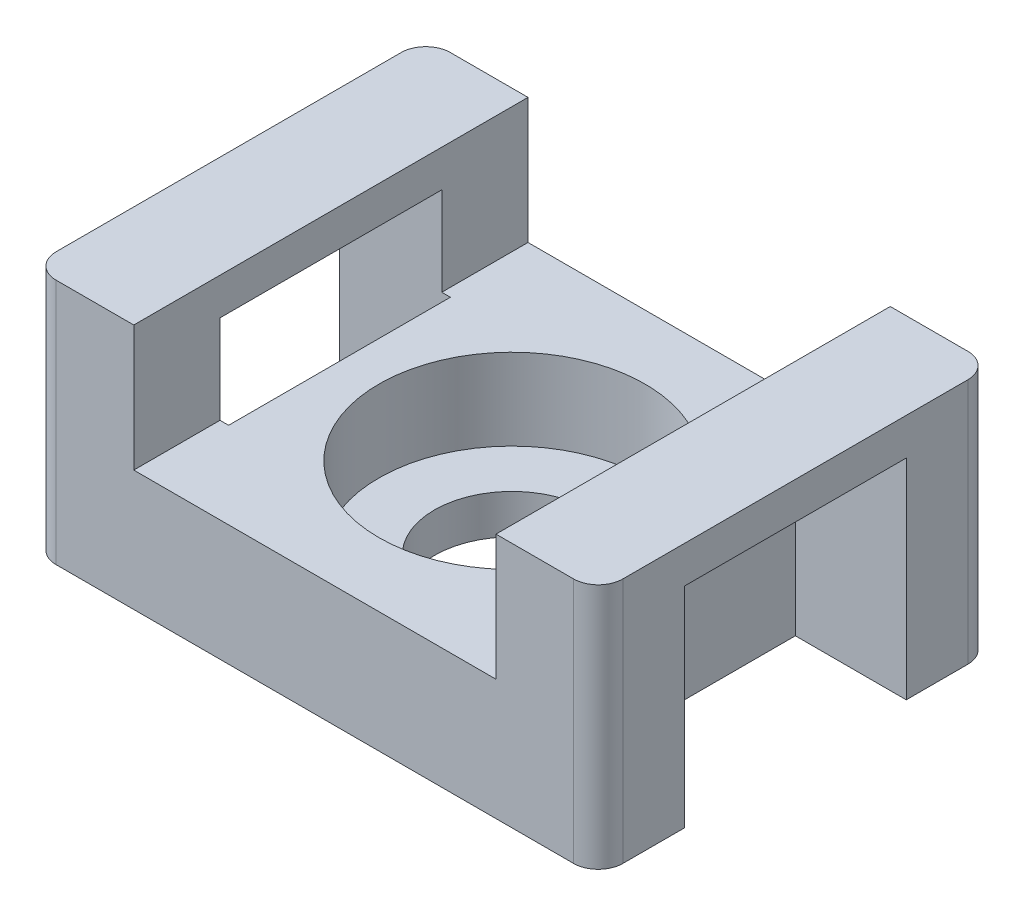
ISO-10303-21;
HEADER;
FILE_DESCRIPTION(('STEP AP214'),'2;1');
FILE_NAME('part.step','',(''),(''),'','','');
FILE_SCHEMA(('AUTOMOTIVE_DESIGN { 1 0 10303 214 1 1 1 1 }'));
ENDSEC;
DATA;
#1=APPLICATION_CONTEXT('core data for automotive mechanical design processes');
#2=APPLICATION_PROTOCOL_DEFINITION('international standard','automotive_design',2000,#1);
#3=PRODUCT_CONTEXT('',#1,'mechanical');
#4=PRODUCT('Part','Part','',(#3));
#5=PRODUCT_RELATED_PRODUCT_CATEGORY('part','',(#4));
#6=PRODUCT_DEFINITION_FORMATION('','',#4);
#7=PRODUCT_DEFINITION_CONTEXT('part definition',#1,'design');
#8=PRODUCT_DEFINITION('design','',#6,#7);
#9=PRODUCT_DEFINITION_SHAPE('','',#8);
#10=(LENGTH_UNIT() NAMED_UNIT(*) SI_UNIT(.MILLI.,.METRE.));
#11=(NAMED_UNIT(*) PLANE_ANGLE_UNIT() SI_UNIT($,.RADIAN.));
#12=(NAMED_UNIT(*) SI_UNIT($,.STERADIAN.) SOLID_ANGLE_UNIT());
#13=UNCERTAINTY_MEASURE_WITH_UNIT(LENGTH_MEASURE(1.E-05),#10,'distance_accuracy_value','');
#14=(GEOMETRIC_REPRESENTATION_CONTEXT(3) GLOBAL_UNCERTAINTY_ASSIGNED_CONTEXT((#13)) GLOBAL_UNIT_ASSIGNED_CONTEXT((#10,
#11,#12)) REPRESENTATION_CONTEXT('',''));
#15=CARTESIAN_POINT('',(0.,0.,0.));
#16=DIRECTION('',(0.,0.,1.));
#17=DIRECTION('',(1.,0.,0.));
#18=AXIS2_PLACEMENT_3D('',#15,#16,#17);
#19=CARTESIAN_POINT('',(-10.8584367165909,7.56649221768157,9.31474506986251));
#20=DIRECTION('',(0.,1.,0.));
#21=DIRECTION('',(0.,0.,1.));
#22=AXIS2_PLACEMENT_3D('',#19,#20,#21);
#23=PLANE('',#22);
#24=DIRECTION('',(-1.,0.,0.));
#25=VECTOR('',#24,1.);
#26=CARTESIAN_POINT('',(-10.8584367165909,7.56649221768157,-6.68525493013749));
#27=LINE('',#26,#25);
#28=CARTESIAN_POINT('',(-6.70843671659086,7.56649221768157,-6.68525493013749));
#29=VERTEX_POINT('',#28);
#30=CARTESIAN_POINT('',(-9.85843671659086,7.56649221768157,-6.68525493013749));
#31=VERTEX_POINT('',#30);
#32=EDGE_CURVE('E206',#29,#31,#27,.T.);
#33=ORIENTED_EDGE('',*,*,#32,.T.);
#34=CARTESIAN_POINT('',(-9.85843671659086,7.56649221768157,-5.68525493013749));
#35=DIRECTION('',(0.,1.,0.));
#36=DIRECTION('',(0.,0.,1.));
#37=AXIS2_PLACEMENT_3D('',#34,#35,#36);
#38=CIRCLE('',#37,1.);
#39=CARTESIAN_POINT('',(-10.8584367165909,7.56649221768157,-5.68525493013749));
#40=VERTEX_POINT('',#39);
#41=EDGE_CURVE('E349',#31,#40,#38,.T.);
#42=ORIENTED_EDGE('',*,*,#41,.T.);
#43=DIRECTION('',(0.,0.,1.));
#44=VECTOR('',#43,1.);
#45=CARTESIAN_POINT('',(-10.8584367165909,7.56649221768157,-6.68525493013749));
#46=LINE('',#45,#44);
#47=CARTESIAN_POINT('',(-10.8584367165909,7.56649221768157,8.31474506986251));
#48=VERTEX_POINT('',#47);
#49=EDGE_CURVE('E303',#40,#48,#46,.T.);
#50=ORIENTED_EDGE('',*,*,#49,.T.);
#51=CARTESIAN_POINT('',(-9.85843671659086,7.56649221768157,8.31474506986251));
#52=DIRECTION('',(0.,1.,0.));
#53=DIRECTION('',(0.,0.,1.));
#54=AXIS2_PLACEMENT_3D('',#51,#52,#53);
#55=CIRCLE('',#54,1.);
#56=CARTESIAN_POINT('',(-9.85843671659086,7.56649221768157,9.31474506986251));
#57=VERTEX_POINT('',#56);
#58=EDGE_CURVE('E347',#48,#57,#55,.T.);
#59=ORIENTED_EDGE('',*,*,#58,.T.);
#60=DIRECTION('',(1.,0.,0.));
#61=VECTOR('',#60,1.);
#62=CARTESIAN_POINT('',(-10.8584367165909,7.56649221768157,9.31474506986251));
#63=LINE('',#62,#61);
#64=CARTESIAN_POINT('',(-6.70843671659086,7.56649221768157,9.31474506986251));
#65=VERTEX_POINT('',#64);
#66=EDGE_CURVE('E308',#57,#65,#63,.T.);
#67=ORIENTED_EDGE('',*,*,#66,.T.);
#68=DIRECTION('',(0.,0.,1.));
#69=VECTOR('',#68,1.);
#70=CARTESIAN_POINT('',(-6.70843671659086,7.56649221768157,-6.68525493013749));
#71=LINE('',#70,#69);
#72=EDGE_CURVE('E221',#29,#65,#71,.T.);
#73=ORIENTED_EDGE('',*,*,#72,.F.);
#74=EDGE_LOOP('',(#33,#42,#50,#59,#67,#73));
#75=FACE_BOUND('',#74,.T.);
#76=ADVANCED_FACE('F16',(#75),#23,.T.);
#77=CARTESIAN_POINT('',(-10.8584367165909,7.56649221768157,-6.68525493013749));
#78=DIRECTION('',(1.,0.,0.));
#79=DIRECTION('',(0.,0.,-1.));
#80=AXIS2_PLACEMENT_3D('',#77,#78,#79);
#81=PLANE('',#80);
#82=ORIENTED_EDGE('',*,*,#49,.F.);
#83=DIRECTION('',(0.,-1.,0.));
#84=VECTOR('',#83,1.);
#85=CARTESIAN_POINT('',(-10.8584367165909,7.56649221768157,-5.68525493013749));
#86=LINE('',#85,#84);
#87=CARTESIAN_POINT('',(-10.8584367165909,-2.43350778231843,-5.68525493013749));
#88=VERTEX_POINT('',#87);
#89=EDGE_CURVE('E331',#40,#88,#86,.T.);
#90=ORIENTED_EDGE('',*,*,#89,.T.);
#91=DIRECTION('',(0.,0.,1.));
#92=VECTOR('',#91,1.);
#93=CARTESIAN_POINT('',(-10.8584367165909,-2.43350778231843,-6.68525493013749));
#94=LINE('',#93,#92);
#95=CARTESIAN_POINT('',(-10.8584367165909,-2.43350778231843,-3.18525493013749));
#96=VERTEX_POINT('',#95);
#97=EDGE_CURVE('E315',#88,#96,#94,.T.);
#98=ORIENTED_EDGE('',*,*,#97,.T.);
#99=DIRECTION('',(0.,1.,0.));
#100=VECTOR('',#99,1.);
#101=CARTESIAN_POINT('',(-10.8584367165909,7.56649221768157,-3.18525493013749));
#102=LINE('',#101,#100);
#103=CARTESIAN_POINT('',(-10.8584367165909,6.06649221768157,-3.18525493013749));
#104=VERTEX_POINT('',#103);
#105=EDGE_CURVE('E254',#96,#104,#102,.T.);
#106=ORIENTED_EDGE('',*,*,#105,.T.);
#107=DIRECTION('',(0.,0.,1.));
#108=VECTOR('',#107,1.);
#109=CARTESIAN_POINT('',(-10.8584367165909,6.06649221768157,-6.68525493013749));
#110=LINE('',#109,#108);
#111=CARTESIAN_POINT('',(-10.8584367165909,6.06649221768157,5.81474506986251));
#112=VERTEX_POINT('',#111);
#113=EDGE_CURVE('E250',#104,#112,#110,.T.);
#114=ORIENTED_EDGE('',*,*,#113,.T.);
#115=DIRECTION('',(0.,-1.,0.));
#116=VECTOR('',#115,1.);
#117=CARTESIAN_POINT('',(-10.8584367165909,7.56649221768157,5.81474506986251));
#118=LINE('',#117,#116);
#119=CARTESIAN_POINT('',(-10.8584367165909,-2.43350778231843,5.81474506986251));
#120=VERTEX_POINT('',#119);
#121=EDGE_CURVE('E263',#112,#120,#118,.T.);
#122=ORIENTED_EDGE('',*,*,#121,.T.);
#123=CARTESIAN_POINT('',(-10.8584367165909,-2.43350778231843,8.31474506986251));
#124=VERTEX_POINT('',#123);
#125=EDGE_CURVE('E296',#120,#124,#94,.T.);
#126=ORIENTED_EDGE('',*,*,#125,.T.);
#127=DIRECTION('',(0.,-1.,0.));
#128=VECTOR('',#127,1.);
#129=CARTESIAN_POINT('',(-10.8584367165909,7.56649221768157,8.31474506986251));
#130=LINE('',#129,#128);
#131=EDGE_CURVE('E329',#124,#48,#130,.F.);
#132=ORIENTED_EDGE('',*,*,#131,.T.);
#133=EDGE_LOOP('',(#82,#90,#98,#106,#114,#122,#126,#132));
#134=FACE_BOUND('',#133,.T.);
#135=ADVANCED_FACE('F394',(#134),#81,.F.);
#136=CARTESIAN_POINT('',(-10.8584367165909,-2.43350778231843,9.31474506986251));
#137=DIRECTION('',(0.,1.,0.));
#138=DIRECTION('',(0.,0.,1.));
#139=AXIS2_PLACEMENT_3D('',#136,#137,#138);
#140=PLANE('',#139);
#141=CARTESIAN_POINT('',(0.641563283409141,-2.43350778231843,1.31474506986251));
#142=DIRECTION('',(0.,1.,0.));
#143=DIRECTION('',(0.,0.,1.));
#144=AXIS2_PLACEMENT_3D('',#141,#142,#143);
#145=CIRCLE('',#144,3.15);
#146=CARTESIAN_POINT('',(0.641563283409141,-2.43350778231843,4.46474506986251));
#147=VERTEX_POINT('',#146);
#148=EDGE_CURVE('E617',#147,#147,#145,.T.);
#149=ORIENTED_EDGE('',*,*,#148,.T.);
#150=EDGE_LOOP('',(#149));
#151=FACE_BOUND('',#150,.T.);
#152=ORIENTED_EDGE('',*,*,#97,.F.);
#153=CARTESIAN_POINT('',(-9.85843671659086,-2.43350778231843,-5.68525493013749));
#154=DIRECTION('',(0.,1.,0.));
#155=DIRECTION('',(0.,0.,1.));
#156=AXIS2_PLACEMENT_3D('',#153,#154,#155);
#157=CIRCLE('',#156,1.);
#158=CARTESIAN_POINT('',(-9.85843671659086,-2.43350778231843,-6.68525493013749));
#159=VERTEX_POINT('',#158);
#160=EDGE_CURVE('E340',#88,#159,#157,.F.);
#161=ORIENTED_EDGE('',*,*,#160,.T.);
#162=DIRECTION('',(-1.,0.,0.));
#163=VECTOR('',#162,1.);
#164=CARTESIAN_POINT('',(-10.8584367165909,-2.43350778231843,-6.68525493013749));
#165=LINE('',#164,#163);
#166=CARTESIAN_POINT('',(11.1415632834091,-2.43350778231843,-6.68525493013749));
#167=VERTEX_POINT('',#166);
#168=EDGE_CURVE('E307',#167,#159,#165,.T.);
#169=ORIENTED_EDGE('',*,*,#168,.F.);
#170=CARTESIAN_POINT('',(11.1415632834091,-2.43350778231843,-5.68525493013749));
#171=DIRECTION('',(0.,1.,0.));
#172=DIRECTION('',(0.,0.,1.));
#173=AXIS2_PLACEMENT_3D('',#170,#171,#172);
#174=CIRCLE('',#173,1.);
#175=CARTESIAN_POINT('',(12.1415632834091,-2.43350778231843,-5.68525493013749));
#176=VERTEX_POINT('',#175);
#177=EDGE_CURVE('E338',#167,#176,#174,.F.);
#178=ORIENTED_EDGE('',*,*,#177,.T.);
#179=DIRECTION('',(0.,0.,-1.));
#180=VECTOR('',#179,1.);
#181=CARTESIAN_POINT('',(12.1415632834091,-2.43350778231843,-6.68525493013749));
#182=LINE('',#181,#180);
#183=CARTESIAN_POINT('',(12.1415632834091,-2.43350778231843,-3.18525493013749));
#184=VERTEX_POINT('',#183);
#185=EDGE_CURVE('E319',#184,#176,#182,.T.);
#186=ORIENTED_EDGE('',*,*,#185,.F.);
#187=DIRECTION('',(1.,0.,0.));
#188=VECTOR('',#187,1.);
#189=CARTESIAN_POINT('',(7.64156328340914,-2.43350778231843,-3.18525493013749));
#190=LINE('',#189,#188);
#191=CARTESIAN_POINT('',(7.64156328340914,-2.43350778231843,-3.18525493013749));
#192=VERTEX_POINT('',#191);
#193=EDGE_CURVE('E299',#192,#184,#190,.T.);
#194=ORIENTED_EDGE('',*,*,#193,.F.);
#195=DIRECTION('',(0.,0.,-1.));
#196=VECTOR('',#195,1.);
#197=CARTESIAN_POINT('',(7.64156328340914,-2.43350778231843,5.81474506986251));
#198=LINE('',#197,#196);
#199=CARTESIAN_POINT('',(7.64156328340914,-2.43350778231843,5.81474506986251));
#200=VERTEX_POINT('',#199);
#201=EDGE_CURVE('E279',#200,#192,#198,.T.);
#202=ORIENTED_EDGE('',*,*,#201,.F.);
#203=DIRECTION('',(1.,0.,0.));
#204=VECTOR('',#203,1.);
#205=CARTESIAN_POINT('',(7.64156328340914,-2.43350778231843,5.81474506986251));
#206=LINE('',#205,#204);
#207=CARTESIAN_POINT('',(12.1415632834091,-2.43350778231843,5.81474506986251));
#208=VERTEX_POINT('',#207);
#209=EDGE_CURVE('E286',#200,#208,#206,.T.);
#210=ORIENTED_EDGE('',*,*,#209,.T.);
#211=CARTESIAN_POINT('',(12.1415632834091,-2.43350778231843,8.31474506986251));
#212=VERTEX_POINT('',#211);
#213=EDGE_CURVE('E320',#212,#208,#182,.T.);
#214=ORIENTED_EDGE('',*,*,#213,.F.);
#215=CARTESIAN_POINT('',(11.1415632834091,-2.43350778231843,8.31474506986251));
#216=DIRECTION('',(0.,1.,0.));
#217=DIRECTION('',(0.,0.,1.));
#218=AXIS2_PLACEMENT_3D('',#215,#216,#217);
#219=CIRCLE('',#218,1.);
#220=CARTESIAN_POINT('',(11.1415632834091,-2.43350778231843,9.31474506986251));
#221=VERTEX_POINT('',#220);
#222=EDGE_CURVE('E336',#212,#221,#219,.F.);
#223=ORIENTED_EDGE('',*,*,#222,.T.);
#224=DIRECTION('',(1.,0.,0.));
#225=VECTOR('',#224,1.);
#226=CARTESIAN_POINT('',(-10.8584367165909,-2.43350778231843,9.31474506986251));
#227=LINE('',#226,#225);
#228=CARTESIAN_POINT('',(-9.85843671659086,-2.43350778231843,9.31474506986251));
#229=VERTEX_POINT('',#228);
#230=EDGE_CURVE('E317',#229,#221,#227,.T.);
#231=ORIENTED_EDGE('',*,*,#230,.F.);
#232=CARTESIAN_POINT('',(-9.85843671659086,-2.43350778231843,8.31474506986251));
#233=DIRECTION('',(0.,1.,0.));
#234=DIRECTION('',(0.,0.,1.));
#235=AXIS2_PLACEMENT_3D('',#232,#233,#234);
#236=CIRCLE('',#235,1.);
#237=EDGE_CURVE('E334',#229,#124,#236,.F.);
#238=ORIENTED_EDGE('',*,*,#237,.T.);
#239=ORIENTED_EDGE('',*,*,#125,.F.);
#240=DIRECTION('',(-1.,0.,0.));
#241=VECTOR('',#240,1.);
#242=CARTESIAN_POINT('',(-6.35843671659086,-2.43350778231843,5.81474506986251));
#243=LINE('',#242,#241);
#244=CARTESIAN_POINT('',(-6.35843671659086,-2.43350778231843,5.81474506986251));
#245=VERTEX_POINT('',#244);
#246=EDGE_CURVE('E272',#245,#120,#243,.T.);
#247=ORIENTED_EDGE('',*,*,#246,.F.);
#248=DIRECTION('',(0.,0.,-1.));
#249=VECTOR('',#248,1.);
#250=CARTESIAN_POINT('',(-6.35843671659086,-2.43350778231843,-6.68525493013749));
#251=LINE('',#250,#249);
#252=CARTESIAN_POINT('',(-6.35843671659086,-2.43350778231843,-3.18525493013749));
#253=VERTEX_POINT('',#252);
#254=EDGE_CURVE('E253',#245,#253,#251,.T.);
#255=ORIENTED_EDGE('',*,*,#254,.T.);
#256=DIRECTION('',(-1.,0.,0.));
#257=VECTOR('',#256,1.);
#258=CARTESIAN_POINT('',(-6.35843671659086,-2.43350778231843,-3.18525493013749));
#259=LINE('',#258,#257);
#260=EDGE_CURVE('E269',#253,#96,#259,.T.);
#261=ORIENTED_EDGE('',*,*,#260,.T.);
#262=EDGE_LOOP('',(#152,#161,#169,#178,#186,#194,#202,#210,#214,#223,#231,#238,#239,#247,#255,#261));
#263=FACE_BOUND('',#262,.T.);
#264=ADVANCED_FACE('F368',(#151,#263),#140,.F.);
#265=CARTESIAN_POINT('',(-10.8584367165909,7.56649221768157,9.31474506986251));
#266=DIRECTION('',(0.,0.,-1.));
#267=DIRECTION('',(-1.,0.,0.));
#268=AXIS2_PLACEMENT_3D('',#265,#266,#267);
#269=PLANE('',#268);
#270=ORIENTED_EDGE('',*,*,#230,.T.);
#271=DIRECTION('',(0.,-1.,0.));
#272=VECTOR('',#271,1.);
#273=CARTESIAN_POINT('',(11.1415632834091,7.56649221768157,9.31474506986251));
#274=LINE('',#273,#272);
#275=CARTESIAN_POINT('',(11.1415632834091,7.56649221768157,9.31474506986251));
#276=VERTEX_POINT('',#275);
#277=EDGE_CURVE('E11',#221,#276,#274,.F.);
#278=ORIENTED_EDGE('',*,*,#277,.T.);
#279=CARTESIAN_POINT('',(7.99156328340914,7.56649221768157,9.31474506986251));
#280=VERTEX_POINT('',#279);
#281=EDGE_CURVE('E306',#280,#276,#63,.T.);
#282=ORIENTED_EDGE('',*,*,#281,.F.);
#283=DIRECTION('',(0.,1.,0.));
#284=VECTOR('',#283,1.);
#285=CARTESIAN_POINT('',(7.99156328340914,7.56649221768157,9.31474506986251));
#286=LINE('',#285,#284);
#287=CARTESIAN_POINT('',(7.99156328340914,2.46649221768157,9.31474506986251));
#288=VERTEX_POINT('',#287);
#289=EDGE_CURVE('E207',#288,#280,#286,.T.);
#290=ORIENTED_EDGE('',*,*,#289,.F.);
#291=DIRECTION('',(1.,0.,0.));
#292=VECTOR('',#291,1.);
#293=CARTESIAN_POINT('',(-6.70843671659086,2.46649221768157,9.31474506986251));
#294=LINE('',#293,#292);
#295=CARTESIAN_POINT('',(-6.70843671659086,2.46649221768157,9.31474506986251));
#296=VERTEX_POINT('',#295);
#297=EDGE_CURVE('E209',#296,#288,#294,.T.);
#298=ORIENTED_EDGE('',*,*,#297,.F.);
#299=DIRECTION('',(0.,-1.,0.));
#300=VECTOR('',#299,1.);
#301=CARTESIAN_POINT('',(-6.70843671659086,7.56649221768157,9.31474506986251));
#302=LINE('',#301,#300);
#303=EDGE_CURVE('E216',#65,#296,#302,.T.);
#304=ORIENTED_EDGE('',*,*,#303,.F.);
#305=ORIENTED_EDGE('',*,*,#66,.F.);
#306=DIRECTION('',(0.,-1.,0.));
#307=VECTOR('',#306,1.);
#308=CARTESIAN_POINT('',(-9.85843671659086,7.56649221768157,9.31474506986251));
#309=LINE('',#308,#307);
#310=EDGE_CURVE('E24',#57,#229,#309,.T.);
#311=ORIENTED_EDGE('',*,*,#310,.T.);
#312=EDGE_LOOP('',(#270,#278,#282,#290,#298,#304,#305,#311));
#313=FACE_BOUND('',#312,.T.);
#314=ADVANCED_FACE('F362',(#313),#269,.F.);
#315=CARTESIAN_POINT('',(12.1415632834091,7.56649221768157,-6.68525493013749));
#316=DIRECTION('',(-1.,0.,0.));
#317=DIRECTION('',(0.,0.,1.));
#318=AXIS2_PLACEMENT_3D('',#315,#316,#317);
#319=PLANE('',#318);
#320=ORIENTED_EDGE('',*,*,#185,.T.);
#321=DIRECTION('',(0.,-1.,0.));
#322=VECTOR('',#321,1.);
#323=CARTESIAN_POINT('',(12.1415632834091,7.56649221768157,-5.68525493013749));
#324=LINE('',#323,#322);
#325=CARTESIAN_POINT('',(12.1415632834091,7.56649221768157,-5.68525493013749));
#326=VERTEX_POINT('',#325);
#327=EDGE_CURVE('E37',#176,#326,#324,.F.);
#328=ORIENTED_EDGE('',*,*,#327,.T.);
#329=DIRECTION('',(0.,0.,-1.));
#330=VECTOR('',#329,1.);
#331=CARTESIAN_POINT('',(12.1415632834091,7.56649221768157,-6.68525493013749));
#332=LINE('',#331,#330);
#333=CARTESIAN_POINT('',(12.1415632834091,7.56649221768157,8.31474506986251));
#334=VERTEX_POINT('',#333);
#335=EDGE_CURVE('E310',#334,#326,#332,.T.);
#336=ORIENTED_EDGE('',*,*,#335,.F.);
#337=DIRECTION('',(0.,-1.,0.));
#338=VECTOR('',#337,1.);
#339=CARTESIAN_POINT('',(12.1415632834091,7.56649221768157,8.31474506986251));
#340=LINE('',#339,#338);
#341=EDGE_CURVE('E351',#334,#212,#340,.T.);
#342=ORIENTED_EDGE('',*,*,#341,.T.);
#343=ORIENTED_EDGE('',*,*,#213,.T.);
#344=DIRECTION('',(0.,-1.,0.));
#345=VECTOR('',#344,1.);
#346=CARTESIAN_POINT('',(12.1415632834091,-2.43350778231843,5.81474506986251));
#347=LINE('',#346,#345);
#348=CARTESIAN_POINT('',(12.1415632834091,6.06649221768157,5.81474506986251));
#349=VERTEX_POINT('',#348);
#350=EDGE_CURVE('E276',#349,#208,#347,.T.);
#351=ORIENTED_EDGE('',*,*,#350,.F.);
#352=DIRECTION('',(0.,0.,1.));
#353=VECTOR('',#352,1.);
#354=CARTESIAN_POINT('',(12.1415632834091,6.06649221768157,5.81474506986251));
#355=LINE('',#354,#353);
#356=CARTESIAN_POINT('',(12.1415632834091,6.06649221768157,-3.18525493013749));
#357=VERTEX_POINT('',#356);
#358=EDGE_CURVE('E280',#357,#349,#355,.T.);
#359=ORIENTED_EDGE('',*,*,#358,.F.);
#360=DIRECTION('',(0.,1.,0.));
#361=VECTOR('',#360,1.);
#362=CARTESIAN_POINT('',(12.1415632834091,-2.43350778231843,-3.18525493013749));
#363=LINE('',#362,#361);
#364=EDGE_CURVE('E289',#184,#357,#363,.T.);
#365=ORIENTED_EDGE('',*,*,#364,.F.);
#366=EDGE_LOOP('',(#320,#328,#336,#342,#343,#351,#359,#365));
#367=FACE_BOUND('',#366,.T.);
#368=ADVANCED_FACE('F376',(#367),#319,.F.);
#369=CARTESIAN_POINT('',(-10.8584367165909,7.56649221768157,-6.68525493013749));
#370=DIRECTION('',(0.,0.,1.));
#371=DIRECTION('',(1.,0.,0.));
#372=AXIS2_PLACEMENT_3D('',#369,#370,#371);
#373=PLANE('',#372);
#374=ORIENTED_EDGE('',*,*,#168,.T.);
#375=DIRECTION('',(0.,-1.,0.));
#376=VECTOR('',#375,1.);
#377=CARTESIAN_POINT('',(-9.85843671659086,7.56649221768157,-6.68525493013749));
#378=LINE('',#377,#376);
#379=EDGE_CURVE('E345',#159,#31,#378,.F.);
#380=ORIENTED_EDGE('',*,*,#379,.T.);
#381=ORIENTED_EDGE('',*,*,#32,.F.);
#382=DIRECTION('',(0.,-1.,0.));
#383=VECTOR('',#382,1.);
#384=CARTESIAN_POINT('',(-6.70843671659086,7.56649221768157,-6.68525493013749));
#385=LINE('',#384,#383);
#386=CARTESIAN_POINT('',(-6.70843671659086,2.46649221768157,-6.68525493013749));
#387=VERTEX_POINT('',#386);
#388=EDGE_CURVE('E183',#29,#387,#385,.T.);
#389=ORIENTED_EDGE('',*,*,#388,.T.);
#390=DIRECTION('',(1.,0.,0.));
#391=VECTOR('',#390,1.);
#392=CARTESIAN_POINT('',(-6.70843671659086,2.46649221768157,-6.68525493013749));
#393=LINE('',#392,#391);
#394=CARTESIAN_POINT('',(7.99156328340914,2.46649221768157,-6.68525493013749));
#395=VERTEX_POINT('',#394);
#396=EDGE_CURVE('E193',#387,#395,#393,.T.);
#397=ORIENTED_EDGE('',*,*,#396,.T.);
#398=DIRECTION('',(0.,1.,0.));
#399=VECTOR('',#398,1.);
#400=CARTESIAN_POINT('',(7.99156328340914,7.56649221768157,-6.68525493013749));
#401=LINE('',#400,#399);
#402=CARTESIAN_POINT('',(7.99156328340914,7.56649221768157,-6.68525493013749));
#403=VERTEX_POINT('',#402);
#404=EDGE_CURVE('E200',#395,#403,#401,.T.);
#405=ORIENTED_EDGE('',*,*,#404,.T.);
#406=CARTESIAN_POINT('',(11.1415632834091,7.56649221768157,-6.68525493013749));
#407=VERTEX_POINT('',#406);
#408=EDGE_CURVE('E312',#407,#403,#27,.T.);
#409=ORIENTED_EDGE('',*,*,#408,.F.);
#410=DIRECTION('',(0.,-1.,0.));
#411=VECTOR('',#410,1.);
#412=CARTESIAN_POINT('',(11.1415632834091,7.56649221768157,-6.68525493013749));
#413=LINE('',#412,#411);
#414=EDGE_CURVE('E342',#407,#167,#413,.T.);
#415=ORIENTED_EDGE('',*,*,#414,.T.);
#416=EDGE_LOOP('',(#374,#380,#381,#389,#397,#405,#409,#415));
#417=FACE_BOUND('',#416,.T.);
#418=ADVANCED_FACE('F204',(#417),#373,.F.);
#419=ORIENTED_EDGE('',*,*,#335,.T.);
#420=CARTESIAN_POINT('',(11.1415632834091,7.56649221768157,-5.68525493013749));
#421=DIRECTION('',(0.,1.,0.));
#422=DIRECTION('',(0.,0.,1.));
#423=AXIS2_PLACEMENT_3D('',#420,#421,#422);
#424=CIRCLE('',#423,1.);
#425=EDGE_CURVE('E357',#326,#407,#424,.T.);
#426=ORIENTED_EDGE('',*,*,#425,.T.);
#427=ORIENTED_EDGE('',*,*,#408,.T.);
#428=DIRECTION('',(0.,0.,1.));
#429=VECTOR('',#428,1.);
#430=CARTESIAN_POINT('',(7.99156328340914,7.56649221768157,-6.68525493013749));
#431=LINE('',#430,#429);
#432=EDGE_CURVE('E224',#403,#280,#431,.T.);
#433=ORIENTED_EDGE('',*,*,#432,.T.);
#434=ORIENTED_EDGE('',*,*,#281,.T.);
#435=CARTESIAN_POINT('',(11.1415632834091,7.56649221768157,8.31474506986251));
#436=DIRECTION('',(0.,1.,0.));
#437=DIRECTION('',(0.,0.,1.));
#438=AXIS2_PLACEMENT_3D('',#435,#436,#437);
#439=CIRCLE('',#438,1.);
#440=EDGE_CURVE('E355',#276,#334,#439,.T.);
#441=ORIENTED_EDGE('',*,*,#440,.T.);
#442=EDGE_LOOP('',(#419,#426,#427,#433,#434,#441));
#443=FACE_BOUND('',#442,.T.);
#444=ADVANCED_FACE('F380',(#443),#23,.T.);
#445=CARTESIAN_POINT('',(7.64156328340914,-2.43350778231843,5.81474506986251));
#446=DIRECTION('',(0.,0.,1.));
#447=DIRECTION('',(1.,0.,0.));
#448=AXIS2_PLACEMENT_3D('',#445,#446,#447);
#449=PLANE('',#448);
#450=DIRECTION('',(1.,0.,0.));
#451=VECTOR('',#450,1.);
#452=CARTESIAN_POINT('',(7.64156328340914,2.46649221768157,5.81474506986251));
#453=LINE('',#452,#451);
#454=CARTESIAN_POINT('',(7.64156328340914,2.46649221768157,5.81474506986251));
#455=VERTEX_POINT('',#454);
#456=CARTESIAN_POINT('',(7.99156328340914,2.46649221768157,5.81474506986251));
#457=VERTEX_POINT('',#456);
#458=EDGE_CURVE('E237',#455,#457,#453,.T.);
#459=ORIENTED_EDGE('',*,*,#458,.T.);
#460=DIRECTION('',(0.,1.,0.));
#461=VECTOR('',#460,1.);
#462=CARTESIAN_POINT('',(7.99156328340914,-2.43350778231843,5.81474506986251));
#463=LINE('',#462,#461);
#464=CARTESIAN_POINT('',(7.99156328340914,6.06649221768157,5.81474506986251));
#465=VERTEX_POINT('',#464);
#466=EDGE_CURVE('E247',#457,#465,#463,.T.);
#467=ORIENTED_EDGE('',*,*,#466,.T.);
#468=DIRECTION('',(1.,0.,0.));
#469=VECTOR('',#468,1.);
#470=CARTESIAN_POINT('',(7.64156328340914,6.06649221768157,5.81474506986251));
#471=LINE('',#470,#469);
#472=EDGE_CURVE('E294',#465,#349,#471,.T.);
#473=ORIENTED_EDGE('',*,*,#472,.T.);
#474=ORIENTED_EDGE('',*,*,#350,.T.);
#475=ORIENTED_EDGE('',*,*,#209,.F.);
#476=DIRECTION('',(0.,-1.,0.));
#477=VECTOR('',#476,1.);
#478=CARTESIAN_POINT('',(7.64156328340914,-2.43350778231843,5.81474506986251));
#479=LINE('',#478,#477);
#480=EDGE_CURVE('E277',#455,#200,#479,.T.);
#481=ORIENTED_EDGE('',*,*,#480,.F.);
#482=EDGE_LOOP('',(#459,#467,#473,#474,#475,#481));
#483=FACE_BOUND('',#482,.T.);
#484=ADVANCED_FACE('F412',(#483),#449,.F.);
#485=CARTESIAN_POINT('',(7.64156328340914,6.06649221768157,5.81474506986251));
#486=DIRECTION('',(0.,1.,0.));
#487=DIRECTION('',(0.,0.,1.));
#488=AXIS2_PLACEMENT_3D('',#485,#486,#487);
#489=PLANE('',#488);
#490=ORIENTED_EDGE('',*,*,#472,.F.);
#491=DIRECTION('',(0.,0.,-1.));
#492=VECTOR('',#491,1.);
#493=CARTESIAN_POINT('',(7.99156328340914,6.06649221768157,5.81474506986251));
#494=LINE('',#493,#492);
#495=CARTESIAN_POINT('',(7.99156328340914,6.06649221768157,-3.18525493013749));
#496=VERTEX_POINT('',#495);
#497=EDGE_CURVE('E244',#465,#496,#494,.T.);
#498=ORIENTED_EDGE('',*,*,#497,.T.);
#499=DIRECTION('',(1.,0.,0.));
#500=VECTOR('',#499,1.);
#501=CARTESIAN_POINT('',(7.64156328340914,6.06649221768157,-3.18525493013749));
#502=LINE('',#501,#500);
#503=EDGE_CURVE('E297',#496,#357,#502,.T.);
#504=ORIENTED_EDGE('',*,*,#503,.T.);
#505=ORIENTED_EDGE('',*,*,#358,.T.);
#506=EDGE_LOOP('',(#490,#498,#504,#505));
#507=FACE_BOUND('',#506,.T.);
#508=ADVANCED_FACE('F417',(#507),#489,.F.);
#509=CARTESIAN_POINT('',(7.64156328340914,-2.43350778231843,-3.18525493013749));
#510=DIRECTION('',(0.,0.,-1.));
#511=DIRECTION('',(-1.,0.,0.));
#512=AXIS2_PLACEMENT_3D('',#509,#510,#511);
#513=PLANE('',#512);
#514=ORIENTED_EDGE('',*,*,#503,.F.);
#515=DIRECTION('',(0.,-1.,0.));
#516=VECTOR('',#515,1.);
#517=CARTESIAN_POINT('',(7.99156328340914,-2.43350778231843,-3.18525493013749));
#518=LINE('',#517,#516);
#519=CARTESIAN_POINT('',(7.99156328340914,2.46649221768157,-3.18525493013749));
#520=VERTEX_POINT('',#519);
#521=EDGE_CURVE('E326',#496,#520,#518,.T.);
#522=ORIENTED_EDGE('',*,*,#521,.T.);
#523=DIRECTION('',(-1.,0.,0.));
#524=VECTOR('',#523,1.);
#525=CARTESIAN_POINT('',(7.64156328340914,2.46649221768157,-3.18525493013749));
#526=LINE('',#525,#524);
#527=CARTESIAN_POINT('',(7.64156328340914,2.46649221768157,-3.18525493013749));
#528=VERTEX_POINT('',#527);
#529=EDGE_CURVE('E234',#520,#528,#526,.T.);
#530=ORIENTED_EDGE('',*,*,#529,.T.);
#531=DIRECTION('',(0.,1.,0.));
#532=VECTOR('',#531,1.);
#533=CARTESIAN_POINT('',(7.64156328340914,-2.43350778231843,-3.18525493013749));
#534=LINE('',#533,#532);
#535=EDGE_CURVE('E283',#192,#528,#534,.T.);
#536=ORIENTED_EDGE('',*,*,#535,.F.);
#537=ORIENTED_EDGE('',*,*,#193,.T.);
#538=ORIENTED_EDGE('',*,*,#364,.T.);
#539=EDGE_LOOP('',(#514,#522,#530,#536,#537,#538));
#540=FACE_BOUND('',#539,.T.);
#541=ADVANCED_FACE('F553',(#540),#513,.F.);
#542=CARTESIAN_POINT('',(7.64156328340914,6.06649221768157,5.81474506986251));
#543=DIRECTION('',(-1.,0.,0.));
#544=DIRECTION('',(0.,0.,1.));
#545=AXIS2_PLACEMENT_3D('',#542,#543,#544);
#546=PLANE('',#545);
#547=ORIENTED_EDGE('',*,*,#535,.T.);
#548=DIRECTION('',(0.,0.,1.));
#549=VECTOR('',#548,1.);
#550=CARTESIAN_POINT('',(7.64156328340914,2.46649221768157,5.81474506986251));
#551=LINE('',#550,#549);
#552=EDGE_CURVE('E231',#528,#455,#551,.T.);
#553=ORIENTED_EDGE('',*,*,#552,.T.);
#554=ORIENTED_EDGE('',*,*,#480,.T.);
#555=ORIENTED_EDGE('',*,*,#201,.T.);
#556=EDGE_LOOP('',(#547,#553,#554,#555));
#557=FACE_BOUND('',#556,.T.);
#558=ADVANCED_FACE('F544',(#557),#546,.F.);
#559=CARTESIAN_POINT('',(-6.35843671659086,6.06649221768157,-6.68525493013749));
#560=DIRECTION('',(0.,-1.,0.));
#561=DIRECTION('',(0.,0.,-1.));
#562=AXIS2_PLACEMENT_3D('',#559,#560,#561);
#563=PLANE('',#562);
#564=DIRECTION('',(0.,0.,-1.));
#565=VECTOR('',#564,1.);
#566=CARTESIAN_POINT('',(-6.70843671659086,6.06649221768157,-6.68525493013749));
#567=LINE('',#566,#565);
#568=CARTESIAN_POINT('',(-6.70843671659086,6.06649221768157,5.81474506986251));
#569=VERTEX_POINT('',#568);
#570=CARTESIAN_POINT('',(-6.70843671659086,6.06649221768157,-3.18525493013749));
#571=VERTEX_POINT('',#570);
#572=EDGE_CURVE('E240',#569,#571,#567,.T.);
#573=ORIENTED_EDGE('',*,*,#572,.F.);
#574=DIRECTION('',(-1.,0.,0.));
#575=VECTOR('',#574,1.);
#576=CARTESIAN_POINT('',(-6.35843671659086,6.06649221768157,5.81474506986251));
#577=LINE('',#576,#575);
#578=EDGE_CURVE('E274',#569,#112,#577,.T.);
#579=ORIENTED_EDGE('',*,*,#578,.T.);
#580=ORIENTED_EDGE('',*,*,#113,.F.);
#581=DIRECTION('',(-1.,0.,0.));
#582=VECTOR('',#581,1.);
#583=CARTESIAN_POINT('',(-6.35843671659086,6.06649221768157,-3.18525493013749));
#584=LINE('',#583,#582);
#585=EDGE_CURVE('E260',#571,#104,#584,.T.);
#586=ORIENTED_EDGE('',*,*,#585,.F.);
#587=EDGE_LOOP('',(#573,#579,#580,#586));
#588=FACE_BOUND('',#587,.T.);
#589=ADVANCED_FACE('F535',(#588),#563,.T.);
#590=CARTESIAN_POINT('',(-6.35843671659086,7.56649221768157,5.81474506986251));
#591=DIRECTION('',(0.,0.,-1.));
#592=DIRECTION('',(-1.,0.,0.));
#593=AXIS2_PLACEMENT_3D('',#590,#591,#592);
#594=PLANE('',#593);
#595=DIRECTION('',(0.,1.,0.));
#596=VECTOR('',#595,1.);
#597=CARTESIAN_POINT('',(-6.70843671659086,7.56649221768157,5.81474506986251));
#598=LINE('',#597,#596);
#599=CARTESIAN_POINT('',(-6.70843671659086,2.46649221768157,5.81474506986251));
#600=VERTEX_POINT('',#599);
#601=EDGE_CURVE('E242',#600,#569,#598,.T.);
#602=ORIENTED_EDGE('',*,*,#601,.F.);
#603=DIRECTION('',(-1.,0.,0.));
#604=VECTOR('',#603,1.);
#605=CARTESIAN_POINT('',(-6.35843671659086,2.46649221768157,5.81474506986251));
#606=LINE('',#605,#604);
#607=CARTESIAN_POINT('',(-6.35843671659086,2.46649221768157,5.81474506986251));
#608=VERTEX_POINT('',#607);
#609=EDGE_CURVE('E229',#608,#600,#606,.T.);
#610=ORIENTED_EDGE('',*,*,#609,.F.);
#611=DIRECTION('',(0.,-1.,0.));
#612=VECTOR('',#611,1.);
#613=CARTESIAN_POINT('',(-6.35843671659086,7.56649221768157,5.81474506986251));
#614=LINE('',#613,#612);
#615=EDGE_CURVE('E251',#608,#245,#614,.T.);
#616=ORIENTED_EDGE('',*,*,#615,.T.);
#617=ORIENTED_EDGE('',*,*,#246,.T.);
#618=ORIENTED_EDGE('',*,*,#121,.F.);
#619=ORIENTED_EDGE('',*,*,#578,.F.);
#620=EDGE_LOOP('',(#602,#610,#616,#617,#618,#619));
#621=FACE_BOUND('',#620,.T.);
#622=ADVANCED_FACE('F526',(#621),#594,.T.);
#623=CARTESIAN_POINT('',(-6.35843671659086,7.56649221768157,-3.18525493013749));
#624=DIRECTION('',(0.,0.,1.));
#625=DIRECTION('',(1.,0.,0.));
#626=AXIS2_PLACEMENT_3D('',#623,#624,#625);
#627=PLANE('',#626);
#628=DIRECTION('',(0.,-1.,0.));
#629=VECTOR('',#628,1.);
#630=CARTESIAN_POINT('',(-6.70843671659086,7.56649221768157,-3.18525493013749));
#631=LINE('',#630,#629);
#632=CARTESIAN_POINT('',(-6.70843671659086,2.46649221768157,-3.18525493013749));
#633=VERTEX_POINT('',#632);
#634=EDGE_CURVE('E186',#571,#633,#631,.T.);
#635=ORIENTED_EDGE('',*,*,#634,.F.);
#636=ORIENTED_EDGE('',*,*,#585,.T.);
#637=ORIENTED_EDGE('',*,*,#105,.F.);
#638=ORIENTED_EDGE('',*,*,#260,.F.);
#639=DIRECTION('',(0.,1.,0.));
#640=VECTOR('',#639,1.);
#641=CARTESIAN_POINT('',(-6.35843671659086,7.56649221768157,-3.18525493013749));
#642=LINE('',#641,#640);
#643=CARTESIAN_POINT('',(-6.35843671659086,2.46649221768157,-3.18525493013749));
#644=VERTEX_POINT('',#643);
#645=EDGE_CURVE('E257',#253,#644,#642,.T.);
#646=ORIENTED_EDGE('',*,*,#645,.T.);
#647=DIRECTION('',(1.,0.,0.));
#648=VECTOR('',#647,1.);
#649=CARTESIAN_POINT('',(-6.35843671659086,2.46649221768157,-3.18525493013749));
#650=LINE('',#649,#648);
#651=EDGE_CURVE('E223',#633,#644,#650,.T.);
#652=ORIENTED_EDGE('',*,*,#651,.F.);
#653=EDGE_LOOP('',(#635,#636,#637,#638,#646,#652));
#654=FACE_BOUND('',#653,.T.);
#655=ADVANCED_FACE('F517',(#654),#627,.T.);
#656=CARTESIAN_POINT('',(-6.35843671659086,6.06649221768157,5.81474506986251));
#657=DIRECTION('',(1.,0.,0.));
#658=DIRECTION('',(0.,0.,-1.));
#659=AXIS2_PLACEMENT_3D('',#656,#657,#658);
#660=PLANE('',#659);
#661=ORIENTED_EDGE('',*,*,#615,.F.);
#662=DIRECTION('',(0.,0.,-1.));
#663=VECTOR('',#662,1.);
#664=CARTESIAN_POINT('',(-6.35843671659086,2.46649221768157,5.81474506986251));
#665=LINE('',#664,#663);
#666=EDGE_CURVE('E314',#608,#644,#665,.T.);
#667=ORIENTED_EDGE('',*,*,#666,.T.);
#668=ORIENTED_EDGE('',*,*,#645,.F.);
#669=ORIENTED_EDGE('',*,*,#254,.F.);
#670=EDGE_LOOP('',(#661,#667,#668,#669));
#671=FACE_BOUND('',#670,.T.);
#672=ADVANCED_FACE('F508',(#671),#660,.F.);
#673=CARTESIAN_POINT('',(7.99156328340914,7.56649221768157,-6.68525493013749));
#674=DIRECTION('',(1.,0.,0.));
#675=DIRECTION('',(0.,1.,0.));
#676=AXIS2_PLACEMENT_3D('',#673,#674,#675);
#677=PLANE('',#676);
#678=DIRECTION('',(0.,0.,1.));
#679=VECTOR('',#678,1.);
#680=CARTESIAN_POINT('',(7.99156328340914,2.46649221768157,-6.68525493013749));
#681=LINE('',#680,#679);
#682=EDGE_CURVE('E189',#457,#288,#681,.T.);
#683=ORIENTED_EDGE('',*,*,#682,.T.);
#684=ORIENTED_EDGE('',*,*,#289,.T.);
#685=ORIENTED_EDGE('',*,*,#432,.F.);
#686=ORIENTED_EDGE('',*,*,#404,.F.);
#687=EDGE_CURVE('E196',#395,#520,#681,.T.);
#688=ORIENTED_EDGE('',*,*,#687,.T.);
#689=ORIENTED_EDGE('',*,*,#521,.F.);
#690=ORIENTED_EDGE('',*,*,#497,.F.);
#691=ORIENTED_EDGE('',*,*,#466,.F.);
#692=EDGE_LOOP('',(#683,#684,#685,#686,#688,#689,#690,#691));
#693=FACE_BOUND('',#692,.T.);
#694=ADVANCED_FACE('F499',(#693),#677,.F.);
#695=CARTESIAN_POINT('',(-6.70843671659086,2.46649221768157,-6.68525493013749));
#696=DIRECTION('',(0.,-1.,0.));
#697=DIRECTION('',(1.,0.,0.));
#698=AXIS2_PLACEMENT_3D('',#695,#696,#697);
#699=PLANE('',#698);
#700=CARTESIAN_POINT('',(0.641563283409141,2.46649221768157,1.31474506986251));
#701=DIRECTION('',(0.,1.,0.));
#702=DIRECTION('',(0.,0.,1.));
#703=AXIS2_PLACEMENT_3D('',#700,#701,#702);
#704=CIRCLE('',#703,5.4);
#705=CARTESIAN_POINT('',(0.641563283409141,2.46649221768157,6.71474506986251));
#706=VERTEX_POINT('',#705);
#707=EDGE_CURVE('E212',#706,#706,#704,.T.);
#708=ORIENTED_EDGE('',*,*,#707,.F.);
#709=EDGE_LOOP('',(#708));
#710=FACE_BOUND('',#709,.T.);
#711=ORIENTED_EDGE('',*,*,#552,.F.);
#712=ORIENTED_EDGE('',*,*,#529,.F.);
#713=ORIENTED_EDGE('',*,*,#687,.F.);
#714=ORIENTED_EDGE('',*,*,#396,.F.);
#715=DIRECTION('',(0.,0.,1.));
#716=VECTOR('',#715,1.);
#717=CARTESIAN_POINT('',(-6.70843671659086,2.46649221768157,-6.68525493013749));
#718=LINE('',#717,#716);
#719=EDGE_CURVE('E178',#387,#633,#718,.T.);
#720=ORIENTED_EDGE('',*,*,#719,.T.);
#721=ORIENTED_EDGE('',*,*,#651,.T.);
#722=ORIENTED_EDGE('',*,*,#666,.F.);
#723=ORIENTED_EDGE('',*,*,#609,.T.);
#724=EDGE_CURVE('E190',#600,#296,#718,.T.);
#725=ORIENTED_EDGE('',*,*,#724,.T.);
#726=ORIENTED_EDGE('',*,*,#297,.T.);
#727=ORIENTED_EDGE('',*,*,#682,.F.);
#728=ORIENTED_EDGE('',*,*,#458,.F.);
#729=EDGE_LOOP('',(#711,#712,#713,#714,#720,#721,#722,#723,#725,#726,#727,#728));
#730=FACE_BOUND('',#729,.T.);
#731=ADVANCED_FACE('F194',(#710,#730),#699,.F.);
#732=CARTESIAN_POINT('',(-6.70843671659086,7.56649221768157,-6.68525493013749));
#733=DIRECTION('',(-1.,0.,0.));
#734=DIRECTION('',(0.,-1.,0.));
#735=AXIS2_PLACEMENT_3D('',#732,#733,#734);
#736=PLANE('',#735);
#737=ORIENTED_EDGE('',*,*,#601,.T.);
#738=ORIENTED_EDGE('',*,*,#572,.T.);
#739=ORIENTED_EDGE('',*,*,#634,.T.);
#740=ORIENTED_EDGE('',*,*,#719,.F.);
#741=ORIENTED_EDGE('',*,*,#388,.F.);
#742=ORIENTED_EDGE('',*,*,#72,.T.);
#743=ORIENTED_EDGE('',*,*,#303,.T.);
#744=ORIENTED_EDGE('',*,*,#724,.F.);
#745=EDGE_LOOP('',(#737,#738,#739,#740,#741,#742,#743,#744));
#746=FACE_BOUND('',#745,.T.);
#747=ADVANCED_FACE('F180',(#746),#736,.F.);
#748=CARTESIAN_POINT('',(0.641563283409141,2.46649221768157,1.31474506986251));
#749=DIRECTION('',(0.,1.,0.));
#750=DIRECTION('',(0.,0.,1.));
#751=AXIS2_PLACEMENT_3D('',#748,#749,#750);
#752=CYLINDRICAL_SURFACE('',#751,5.4);
#753=CARTESIAN_POINT('',(0.641563283409141,-0.833507782318428,1.31474506986251));
#754=DIRECTION('',(0.,1.,0.));
#755=DIRECTION('',(0.,0.,1.));
#756=AXIS2_PLACEMENT_3D('',#753,#754,#755);
#757=CIRCLE('',#756,5.4);
#758=CARTESIAN_POINT('',(0.641563283409141,-0.833507782318428,6.71474506986251));
#759=VERTEX_POINT('',#758);
#760=EDGE_CURVE('E621',#759,#759,#757,.T.);
#761=ORIENTED_EDGE('',*,*,#760,.F.);
#762=EDGE_LOOP('',(#761));
#763=FACE_BOUND('',#762,.T.);
#764=ORIENTED_EDGE('',*,*,#707,.T.);
#765=EDGE_LOOP('',(#764));
#766=FACE_BOUND('',#765,.T.);
#767=ADVANCED_FACE('F475',(#763,#766),#752,.F.);
#768=CARTESIAN_POINT('',(3.79156328340914,-0.833507782318428,1.31474506986251));
#769=DIRECTION('',(0.,-1.,0.));
#770=DIRECTION('',(0.,0.,-1.));
#771=AXIS2_PLACEMENT_3D('',#768,#769,#770);
#772=PLANE('',#771);
#773=CARTESIAN_POINT('',(0.641563283409141,-0.833507782318428,1.31474506986251));
#774=DIRECTION('',(0.,1.,0.));
#775=DIRECTION('',(0.,0.,1.));
#776=AXIS2_PLACEMENT_3D('',#773,#774,#775);
#777=CIRCLE('',#776,3.15);
#778=CARTESIAN_POINT('',(0.641563283409141,-0.833507782318428,4.46474506986251));
#779=VERTEX_POINT('',#778);
#780=EDGE_CURVE('E618',#779,#779,#777,.T.);
#781=ORIENTED_EDGE('',*,*,#780,.F.);
#782=EDGE_LOOP('',(#781));
#783=FACE_BOUND('',#782,.T.);
#784=ORIENTED_EDGE('',*,*,#760,.T.);
#785=EDGE_LOOP('',(#784));
#786=FACE_BOUND('',#785,.T.);
#787=ADVANCED_FACE('F466',(#783,#786),#772,.F.);
#788=CARTESIAN_POINT('',(0.641563283409141,2.46649221768157,1.31474506986251));
#789=DIRECTION('',(0.,1.,0.));
#790=DIRECTION('',(0.,0.,1.));
#791=AXIS2_PLACEMENT_3D('',#788,#789,#790);
#792=CYLINDRICAL_SURFACE('',#791,3.15);
#793=ORIENTED_EDGE('',*,*,#148,.F.);
#794=EDGE_LOOP('',(#793));
#795=FACE_BOUND('',#794,.T.);
#796=ORIENTED_EDGE('',*,*,#780,.T.);
#797=EDGE_LOOP('',(#796));
#798=FACE_BOUND('',#797,.T.);
#799=ADVANCED_FACE('F429',(#795,#798),#792,.F.);
#800=CARTESIAN_POINT('',(-9.85843671659086,7.56649221768157,-5.68525493013749));
#801=DIRECTION('',(0.,-1.,0.));
#802=DIRECTION('',(0.,0.,-1.));
#803=AXIS2_PLACEMENT_3D('',#800,#801,#802);
#804=CYLINDRICAL_SURFACE('',#803,1.);
#805=ORIENTED_EDGE('',*,*,#41,.F.);
#806=ORIENTED_EDGE('',*,*,#379,.F.);
#807=ORIENTED_EDGE('',*,*,#160,.F.);
#808=ORIENTED_EDGE('',*,*,#89,.F.);
#809=EDGE_LOOP('',(#805,#806,#807,#808));
#810=FACE_BOUND('',#809,.T.);
#811=ADVANCED_FACE('F391',(#810),#804,.T.);
#812=CARTESIAN_POINT('',(11.1415632834091,7.56649221768157,-5.68525493013749));
#813=DIRECTION('',(0.,-1.,0.));
#814=DIRECTION('',(0.,0.,-1.));
#815=AXIS2_PLACEMENT_3D('',#812,#813,#814);
#816=CYLINDRICAL_SURFACE('',#815,1.);
#817=ORIENTED_EDGE('',*,*,#425,.F.);
#818=ORIENTED_EDGE('',*,*,#327,.F.);
#819=ORIENTED_EDGE('',*,*,#177,.F.);
#820=ORIENTED_EDGE('',*,*,#414,.F.);
#821=EDGE_LOOP('',(#817,#818,#819,#820));
#822=FACE_BOUND('',#821,.T.);
#823=ADVANCED_FACE('F384',(#822),#816,.T.);
#824=CARTESIAN_POINT('',(11.1415632834091,7.56649221768157,8.31474506986251));
#825=DIRECTION('',(0.,-1.,0.));
#826=DIRECTION('',(0.,0.,-1.));
#827=AXIS2_PLACEMENT_3D('',#824,#825,#826);
#828=CYLINDRICAL_SURFACE('',#827,1.);
#829=ORIENTED_EDGE('',*,*,#440,.F.);
#830=ORIENTED_EDGE('',*,*,#277,.F.);
#831=ORIENTED_EDGE('',*,*,#222,.F.);
#832=ORIENTED_EDGE('',*,*,#341,.F.);
#833=EDGE_LOOP('',(#829,#830,#831,#832));
#834=FACE_BOUND('',#833,.T.);
#835=ADVANCED_FACE('F375',(#834),#828,.T.);
#836=CARTESIAN_POINT('',(-9.85843671659086,7.56649221768157,8.31474506986251));
#837=DIRECTION('',(0.,-1.,0.));
#838=DIRECTION('',(0.,0.,-1.));
#839=AXIS2_PLACEMENT_3D('',#836,#837,#838);
#840=CYLINDRICAL_SURFACE('',#839,1.);
#841=ORIENTED_EDGE('',*,*,#58,.F.);
#842=ORIENTED_EDGE('',*,*,#131,.F.);
#843=ORIENTED_EDGE('',*,*,#237,.F.);
#844=ORIENTED_EDGE('',*,*,#310,.F.);
#845=EDGE_LOOP('',(#841,#842,#843,#844));
#846=FACE_BOUND('',#845,.T.);
#847=ADVANCED_FACE('F18',(#846),#840,.T.);
#848=CLOSED_SHELL('',(#76,#135,#264,#314,#368,#418,#444,#484,#508,#541,#558,#589,#622,#655,#672,
#694,#731,#747,#767,#787,#799,#811,#823,#835,#847));
#849=MANIFOLD_SOLID_BREP('B1',#848);
#850=ADVANCED_BREP_SHAPE_REPRESENTATION('',(#18,#849),#14);
#851=SHAPE_DEFINITION_REPRESENTATION(#9,#850);
ENDSEC;
END-ISO-10303-21;
